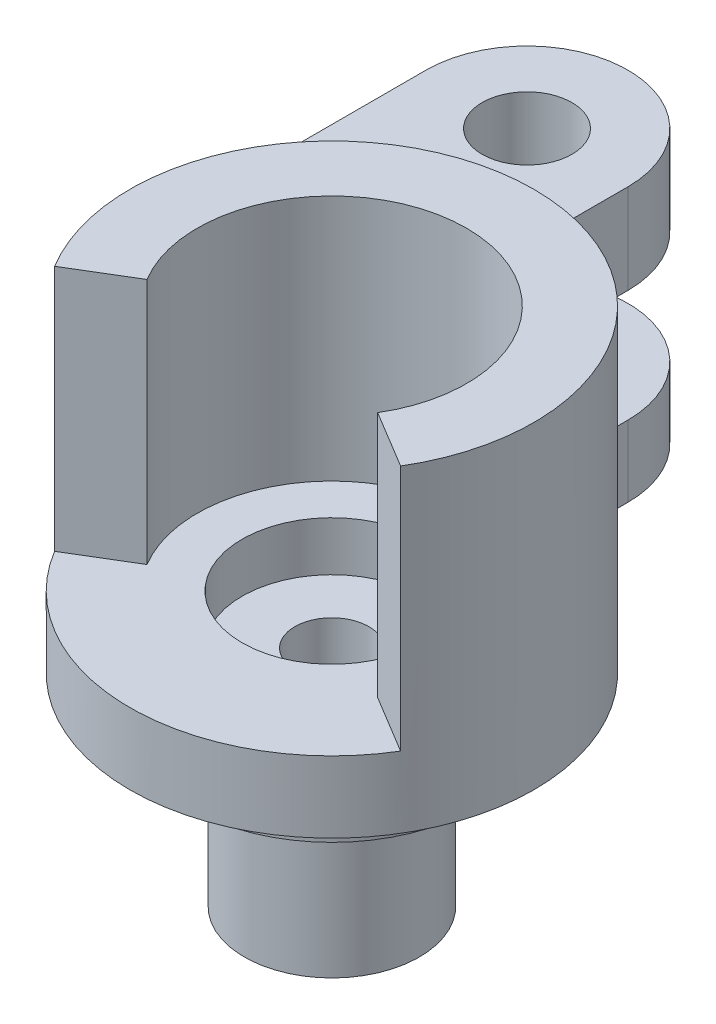
ISO-10303-21;
HEADER;
FILE_DESCRIPTION(('STEP AP214'),'2;1');
FILE_NAME('part.step','',(''),(''),'','','');
FILE_SCHEMA(('AUTOMOTIVE_DESIGN { 1 0 10303 214 1 1 1 1 }'));
ENDSEC;
DATA;
#1=APPLICATION_CONTEXT('core data for automotive mechanical design processes');
#2=APPLICATION_PROTOCOL_DEFINITION('international standard','automotive_design',2000,#1);
#3=PRODUCT_CONTEXT('',#1,'mechanical');
#4=PRODUCT('Part','Part','',(#3));
#5=PRODUCT_RELATED_PRODUCT_CATEGORY('part','',(#4));
#6=PRODUCT_DEFINITION_FORMATION('','',#4);
#7=PRODUCT_DEFINITION_CONTEXT('part definition',#1,'design');
#8=PRODUCT_DEFINITION('design','',#6,#7);
#9=PRODUCT_DEFINITION_SHAPE('','',#8);
#10=(LENGTH_UNIT() NAMED_UNIT(*) SI_UNIT(.MILLI.,.METRE.));
#11=(NAMED_UNIT(*) PLANE_ANGLE_UNIT() SI_UNIT($,.RADIAN.));
#12=(NAMED_UNIT(*) SI_UNIT($,.STERADIAN.) SOLID_ANGLE_UNIT());
#13=UNCERTAINTY_MEASURE_WITH_UNIT(LENGTH_MEASURE(1.E-05),#10,'distance_accuracy_value','');
#14=(GEOMETRIC_REPRESENTATION_CONTEXT(3) GLOBAL_UNCERTAINTY_ASSIGNED_CONTEXT((#13)) GLOBAL_UNIT_ASSIGNED_CONTEXT((#10,
#11,#12)) REPRESENTATION_CONTEXT('',''));
#15=CARTESIAN_POINT('',(0.,0.,0.));
#16=DIRECTION('',(0.,0.,1.));
#17=DIRECTION('',(1.,0.,0.));
#18=AXIS2_PLACEMENT_3D('',#15,#16,#17);
#19=CARTESIAN_POINT('',(0.,-13.6669047975957,0.));
#20=DIRECTION('',(0.,1.,0.));
#21=DIRECTION('',(0.,0.,1.));
#22=AXIS2_PLACEMENT_3D('',#19,#20,#21);
#23=CYLINDRICAL_SURFACE('',#22,1.650000048);
#24=CARTESIAN_POINT('',(0.,-8.999999906,0.));
#25=DIRECTION('',(0.,-1.,0.));
#26=DIRECTION('',(0.,0.,-1.));
#27=AXIS2_PLACEMENT_3D('',#24,#25,#26);
#28=CIRCLE('',#27,1.650000048);
#29=CARTESIAN_POINT('',(0.,-8.999999906,-1.650000048));
#30=VERTEX_POINT('',#29);
#31=EDGE_CURVE('E626',#30,#30,#28,.F.);
#32=ORIENTED_EDGE('',*,*,#31,.F.);
#33=EDGE_LOOP('',(#32));
#34=FACE_BOUND('',#33,.T.);
#35=CARTESIAN_POINT('',(0.,0.975,0.));
#36=DIRECTION('',(0.,1.,0.));
#37=DIRECTION('',(0.,0.,1.));
#38=AXIS2_PLACEMENT_3D('',#35,#36,#37);
#39=CIRCLE('',#38,1.650000048);
#40=CARTESIAN_POINT('',(0.,0.975,1.650000048));
#41=VERTEX_POINT('',#40);
#42=EDGE_CURVE('E47',#41,#41,#39,.F.);
#43=ORIENTED_EDGE('',*,*,#42,.F.);
#44=EDGE_LOOP('',(#43));
#45=FACE_BOUND('',#44,.T.);
#46=ADVANCED_FACE('F43',(#34,#45),#23,.F.);
#47=CARTESIAN_POINT('',(0.,3.175,0.));
#48=DIRECTION('',(0.,-1.,0.));
#49=DIRECTION('',(0.,0.,-1.));
#50=AXIS2_PLACEMENT_3D('',#47,#48,#49);
#51=CYLINDRICAL_SURFACE('',#50,9.);
#52=DIRECTION('',(0.,-1.,0.));
#53=VECTOR('',#52,1.);
#54=CARTESIAN_POINT('',(0.,12.174999906,-9.));
#55=LINE('',#54,#53);
#56=CARTESIAN_POINT('',(0.,12.174999906,-9.));
#57=VERTEX_POINT('',#56);
#58=CARTESIAN_POINT('',(0.,8.174999906,-9.));
#59=VERTEX_POINT('',#58);
#60=EDGE_CURVE('E61',#57,#59,#55,.T.);
#61=ORIENTED_EDGE('',*,*,#60,.F.);
#62=CARTESIAN_POINT('',(0.,12.174999906,0.));
#63=DIRECTION('',(0.,-1.,0.));
#64=DIRECTION('',(0.,0.,1.));
#65=AXIS2_PLACEMENT_3D('',#62,#63,#64);
#66=CIRCLE('',#65,9.);
#67=CARTESIAN_POINT('',(-9.,12.174999906,0.));
#68=VERTEX_POINT('',#67);
#69=EDGE_CURVE('E66',#68,#57,#66,.T.);
#70=ORIENTED_EDGE('',*,*,#69,.F.);
#71=DIRECTION('',(0.,-1.,0.));
#72=VECTOR('',#71,1.);
#73=CARTESIAN_POINT('',(-9.,12.174999906,0.));
#74=LINE('',#73,#72);
#75=CARTESIAN_POINT('',(-9.,8.174999906,0.));
#76=VERTEX_POINT('',#75);
#77=EDGE_CURVE('E158',#68,#76,#74,.T.);
#78=ORIENTED_EDGE('',*,*,#77,.T.);
#79=CARTESIAN_POINT('',(0.,8.174999906,0.));
#80=DIRECTION('',(0.,-1.,0.));
#81=DIRECTION('',(0.,0.,1.));
#82=AXIS2_PLACEMENT_3D('',#79,#80,#81);
#83=CIRCLE('',#82,9.);
#84=EDGE_CURVE('E162',#76,#59,#83,.T.);
#85=ORIENTED_EDGE('',*,*,#84,.T.);
#86=EDGE_LOOP('',(#61,#70,#78,#85));
#87=FACE_BOUND('',#86,.T.);
#88=CARTESIAN_POINT('',(0.,3.175,0.));
#89=DIRECTION('',(0.,1.,0.));
#90=DIRECTION('',(0.,0.,1.));
#91=AXIS2_PLACEMENT_3D('',#88,#89,#90);
#92=CIRCLE('',#91,9.);
#93=CARTESIAN_POINT('',(-7.70770438364841,3.175,4.64664321142554));
#94=VERTEX_POINT('',#93);
#95=CARTESIAN_POINT('',(7.70770438364841,3.175,4.64664321142554));
#96=VERTEX_POINT('',#95);
#97=EDGE_CURVE('E235',#94,#96,#92,.T.);
#98=ORIENTED_EDGE('',*,*,#97,.F.);
#99=DIRECTION('',(0.,-1.,0.));
#100=VECTOR('',#99,1.);
#101=CARTESIAN_POINT('',(-7.70770438364841,14.175,4.64664321142554));
#102=LINE('',#101,#100);
#103=CARTESIAN_POINT('',(-7.70770438364841,14.175,4.64664321142554));
#104=VERTEX_POINT('',#103);
#105=EDGE_CURVE('E272',#104,#94,#102,.T.);
#106=ORIENTED_EDGE('',*,*,#105,.F.);
#107=CARTESIAN_POINT('',(0.,14.175,0.));
#108=DIRECTION('',(0.,1.,0.));
#109=DIRECTION('',(0.,0.,-1.));
#110=AXIS2_PLACEMENT_3D('',#107,#108,#109);
#111=CIRCLE('',#110,9.);
#112=CARTESIAN_POINT('',(7.70770438364841,14.175,4.64664321142554));
#113=VERTEX_POINT('',#112);
#114=EDGE_CURVE('E236',#113,#104,#111,.T.);
#115=ORIENTED_EDGE('',*,*,#114,.F.);
#116=DIRECTION('',(0.,-1.,0.));
#117=VECTOR('',#116,1.);
#118=CARTESIAN_POINT('',(7.70770438364841,14.175,4.64664321142554));
#119=LINE('',#118,#117);
#120=EDGE_CURVE('E250',#113,#96,#119,.T.);
#121=ORIENTED_EDGE('',*,*,#120,.T.);
#122=EDGE_LOOP('',(#98,#106,#115,#121));
#123=FACE_BOUND('',#122,.T.);
#124=DIRECTION('',(0.,-1.,0.));
#125=VECTOR('',#124,1.);
#126=CARTESIAN_POINT('',(0.,23.0265647372949,-9.));
#127=LINE('',#126,#125);
#128=CARTESIAN_POINT('',(0.,3.175,-9.));
#129=VERTEX_POINT('',#128);
#130=CARTESIAN_POINT('',(0.,0.,-9.));
#131=VERTEX_POINT('',#130);
#132=EDGE_CURVE('E197',#129,#131,#127,.T.);
#133=ORIENTED_EDGE('',*,*,#132,.F.);
#134=CARTESIAN_POINT('',(0.,3.175,0.));
#135=DIRECTION('',(0.,1.,0.));
#136=DIRECTION('',(0.,0.,1.));
#137=AXIS2_PLACEMENT_3D('',#134,#135,#136);
#138=CIRCLE('',#137,9.);
#139=CARTESIAN_POINT('',(-9.,3.175,0.));
#140=VERTEX_POINT('',#139);
#141=EDGE_CURVE('E207',#140,#129,#138,.F.);
#142=ORIENTED_EDGE('',*,*,#141,.F.);
#143=DIRECTION('',(0.,-1.,0.));
#144=VECTOR('',#143,1.);
#145=CARTESIAN_POINT('',(-9.,23.0265647372949,0.));
#146=LINE('',#145,#144);
#147=CARTESIAN_POINT('',(-9.,0.,0.));
#148=VERTEX_POINT('',#147);
#149=EDGE_CURVE('E181',#140,#148,#146,.T.);
#150=ORIENTED_EDGE('',*,*,#149,.T.);
#151=CARTESIAN_POINT('',(0.,0.,0.));
#152=DIRECTION('',(0.,1.,0.));
#153=DIRECTION('',(0.,0.,1.));
#154=AXIS2_PLACEMENT_3D('',#151,#152,#153);
#155=CIRCLE('',#154,9.);
#156=EDGE_CURVE('E276',#148,#131,#155,.T.);
#157=ORIENTED_EDGE('',*,*,#156,.T.);
#158=EDGE_LOOP('',(#133,#142,#150,#157));
#159=FACE_BOUND('',#158,.T.);
#160=ADVANCED_FACE('F45',(#87,#123,#159),#51,.T.);
#161=CARTESIAN_POINT('',(0.,3.175,0.));
#162=DIRECTION('',(0.,1.,0.));
#163=DIRECTION('',(0.,0.,1.));
#164=AXIS2_PLACEMENT_3D('',#161,#162,#163);
#165=PLANE('',#164);
#166=CARTESIAN_POINT('',(0.,3.175,0.));
#167=DIRECTION('',(0.,1.,0.));
#168=DIRECTION('',(0.,0.,1.));
#169=AXIS2_PLACEMENT_3D('',#166,#167,#168);
#170=CIRCLE('',#169,4.);
#171=CARTESIAN_POINT('',(0.,3.175,4.));
#172=VERTEX_POINT('',#171);
#173=EDGE_CURVE('E602',#172,#172,#170,.T.);
#174=ORIENTED_EDGE('',*,*,#173,.F.);
#175=EDGE_LOOP('',(#174));
#176=FACE_BOUND('',#175,.T.);
#177=DIRECTION('',(0.856411598183157,0.,0.516293690158394));
#178=VECTOR('',#177,1.);
#179=CARTESIAN_POINT('',(5.13846958909894,3.175,3.09776214095036));
#180=LINE('',#179,#178);
#181=CARTESIAN_POINT('',(5.13846958909894,3.175,3.09776214095036));
#182=VERTEX_POINT('',#181);
#183=EDGE_CURVE('E241',#182,#96,#180,.T.);
#184=ORIENTED_EDGE('',*,*,#183,.F.);
#185=CARTESIAN_POINT('',(0.,3.175,0.));
#186=DIRECTION('',(0.,-1.,0.));
#187=DIRECTION('',(0.,0.,-1.));
#188=AXIS2_PLACEMENT_3D('',#185,#186,#187);
#189=CIRCLE('',#188,6.);
#190=CARTESIAN_POINT('',(-5.13846958909894,3.175,3.09776214095036));
#191=VERTEX_POINT('',#190);
#192=EDGE_CURVE('E254',#191,#182,#189,.T.);
#193=ORIENTED_EDGE('',*,*,#192,.F.);
#194=DIRECTION('',(0.856411598183157,0.,-0.516293690158393));
#195=VECTOR('',#194,1.);
#196=CARTESIAN_POINT('',(-7.70770438364841,3.175,4.64664321142554));
#197=LINE('',#196,#195);
#198=EDGE_CURVE('E231',#94,#191,#197,.T.);
#199=ORIENTED_EDGE('',*,*,#198,.F.);
#200=ORIENTED_EDGE('',*,*,#97,.T.);
#201=EDGE_LOOP('',(#184,#193,#199,#200));
#202=FACE_BOUND('',#201,.T.);
#203=ADVANCED_FACE('F315',(#176,#202),#165,.T.);
#204=CARTESIAN_POINT('',(0.,0.,0.));
#205=DIRECTION('',(0.,1.,0.));
#206=DIRECTION('',(0.,0.,1.));
#207=AXIS2_PLACEMENT_3D('',#204,#205,#206);
#208=PLANE('',#207);
#209=CARTESIAN_POINT('',(0.,0.,0.));
#210=DIRECTION('',(0.,-1.,0.));
#211=DIRECTION('',(0.,0.,-1.));
#212=AXIS2_PLACEMENT_3D('',#209,#210,#211);
#213=CIRCLE('',#212,6.399999954);
#214=CARTESIAN_POINT('',(0.,0.,-6.399999954));
#215=VERTEX_POINT('',#214);
#216=EDGE_CURVE('E53',#215,#215,#213,.T.);
#217=ORIENTED_EDGE('',*,*,#216,.F.);
#218=EDGE_LOOP('',(#217));
#219=FACE_BOUND('',#218,.T.);
#220=ORIENTED_EDGE('',*,*,#156,.F.);
#221=DIRECTION('',(0.,0.,1.));
#222=VECTOR('',#221,1.);
#223=CARTESIAN_POINT('',(-9.,0.,0.));
#224=LINE('',#223,#222);
#225=CARTESIAN_POINT('',(-9.,0.,-13.1941974251168));
#226=VERTEX_POINT('',#225);
#227=EDGE_CURVE('E182',#226,#148,#224,.T.);
#228=ORIENTED_EDGE('',*,*,#227,.F.);
#229=CARTESIAN_POINT('',(-4.5,0.,-13.1941974251168));
#230=DIRECTION('',(0.,1.,0.));
#231=DIRECTION('',(0.,0.,1.));
#232=AXIS2_PLACEMENT_3D('',#229,#230,#231);
#233=CIRCLE('',#232,4.5);
#234=CARTESIAN_POINT('',(0.,0.,-13.1941974251168));
#235=VERTEX_POINT('',#234);
#236=EDGE_CURVE('E188',#235,#226,#233,.T.);
#237=ORIENTED_EDGE('',*,*,#236,.F.);
#238=DIRECTION('',(0.,0.,-1.));
#239=VECTOR('',#238,1.);
#240=CARTESIAN_POINT('',(0.,0.,-9.));
#241=LINE('',#240,#239);
#242=EDGE_CURVE('E193',#131,#235,#241,.T.);
#243=ORIENTED_EDGE('',*,*,#242,.F.);
#244=EDGE_LOOP('',(#220,#228,#237,#243));
#245=FACE_BOUND('',#244,.T.);
#246=ADVANCED_FACE('F289',(#219,#245),#208,.F.);
#247=CARTESIAN_POINT('',(-7.70770438364841,14.175,4.64664321142554));
#248=DIRECTION('',(-0.516293690158393,0.,-0.856411598183157));
#249=DIRECTION('',(-0.856411598183157,0.,0.516293690158393));
#250=AXIS2_PLACEMENT_3D('',#247,#248,#249);
#251=PLANE('',#250);
#252=ORIENTED_EDGE('',*,*,#198,.T.);
#253=DIRECTION('',(0.,-1.,0.));
#254=VECTOR('',#253,1.);
#255=CARTESIAN_POINT('',(-5.13846958909894,14.175,3.09776214095036));
#256=LINE('',#255,#254);
#257=CARTESIAN_POINT('',(-5.13846958909894,14.175,3.09776214095036));
#258=VERTEX_POINT('',#257);
#259=EDGE_CURVE('E268',#258,#191,#256,.T.);
#260=ORIENTED_EDGE('',*,*,#259,.F.);
#261=DIRECTION('',(0.856411598183157,0.,-0.516293690158393));
#262=VECTOR('',#261,1.);
#263=CARTESIAN_POINT('',(-7.70770438364841,14.175,4.64664321142554));
#264=LINE('',#263,#262);
#265=EDGE_CURVE('E240',#104,#258,#264,.T.);
#266=ORIENTED_EDGE('',*,*,#265,.F.);
#267=ORIENTED_EDGE('',*,*,#105,.T.);
#268=EDGE_LOOP('',(#252,#260,#266,#267));
#269=FACE_BOUND('',#268,.T.);
#270=ADVANCED_FACE('F477',(#269),#251,.F.);
#271=CARTESIAN_POINT('',(0.,14.175,0.));
#272=DIRECTION('',(0.,-1.,0.));
#273=DIRECTION('',(0.,0.,-1.));
#274=AXIS2_PLACEMENT_3D('',#271,#272,#273);
#275=CYLINDRICAL_SURFACE('',#274,6.);
#276=ORIENTED_EDGE('',*,*,#192,.T.);
#277=DIRECTION('',(0.,-1.,0.));
#278=VECTOR('',#277,1.);
#279=CARTESIAN_POINT('',(5.13846958909894,14.175,3.09776214095036));
#280=LINE('',#279,#278);
#281=CARTESIAN_POINT('',(5.13846958909894,14.175,3.09776214095036));
#282=VERTEX_POINT('',#281);
#283=EDGE_CURVE('E264',#282,#182,#280,.T.);
#284=ORIENTED_EDGE('',*,*,#283,.F.);
#285=CARTESIAN_POINT('',(0.,14.175,0.));
#286=DIRECTION('',(0.,-1.,0.));
#287=DIRECTION('',(0.,0.,-1.));
#288=AXIS2_PLACEMENT_3D('',#285,#286,#287);
#289=CIRCLE('',#288,6.);
#290=EDGE_CURVE('E244',#258,#282,#289,.T.);
#291=ORIENTED_EDGE('',*,*,#290,.F.);
#292=ORIENTED_EDGE('',*,*,#259,.T.);
#293=EDGE_LOOP('',(#276,#284,#291,#292));
#294=FACE_BOUND('',#293,.T.);
#295=ADVANCED_FACE('F546',(#294),#275,.F.);
#296=CARTESIAN_POINT('',(5.13846958909894,14.175,3.09776214095036));
#297=DIRECTION('',(0.516293690158394,0.,-0.856411598183157));
#298=DIRECTION('',(-0.856411598183157,0.,-0.516293690158394));
#299=AXIS2_PLACEMENT_3D('',#296,#297,#298);
#300=PLANE('',#299);
#301=ORIENTED_EDGE('',*,*,#183,.T.);
#302=ORIENTED_EDGE('',*,*,#120,.F.);
#303=DIRECTION('',(0.856411598183157,0.,0.516293690158394));
#304=VECTOR('',#303,1.);
#305=CARTESIAN_POINT('',(5.13846958909894,14.175,3.09776214095036));
#306=LINE('',#305,#304);
#307=EDGE_CURVE('E247',#282,#113,#306,.T.);
#308=ORIENTED_EDGE('',*,*,#307,.F.);
#309=ORIENTED_EDGE('',*,*,#283,.T.);
#310=EDGE_LOOP('',(#301,#302,#308,#309));
#311=FACE_BOUND('',#310,.T.);
#312=ADVANCED_FACE('F536',(#311),#300,.F.);
#313=CARTESIAN_POINT('',(0.,14.175,0.));
#314=DIRECTION('',(0.,-1.,0.));
#315=DIRECTION('',(0.,0.,-1.));
#316=AXIS2_PLACEMENT_3D('',#313,#314,#315);
#317=PLANE('',#316);
#318=ORIENTED_EDGE('',*,*,#114,.T.);
#319=ORIENTED_EDGE('',*,*,#265,.T.);
#320=ORIENTED_EDGE('',*,*,#290,.T.);
#321=ORIENTED_EDGE('',*,*,#307,.T.);
#322=EDGE_LOOP('',(#318,#319,#320,#321));
#323=FACE_BOUND('',#322,.T.);
#324=ADVANCED_FACE('F526',(#323),#317,.F.);
#325=CARTESIAN_POINT('',(0.,-2.,0.));
#326=DIRECTION('',(0.,1.,0.));
#327=DIRECTION('',(0.,0.,1.));
#328=AXIS2_PLACEMENT_3D('',#325,#326,#327);
#329=CYLINDRICAL_SURFACE('',#328,6.399999954);
#330=CARTESIAN_POINT('',(0.,-2.,0.));
#331=DIRECTION('',(0.,-1.,0.));
#332=DIRECTION('',(0.,0.,-1.));
#333=AXIS2_PLACEMENT_3D('',#330,#331,#332);
#334=CIRCLE('',#333,6.399999954);
#335=CARTESIAN_POINT('',(0.,-2.,-6.399999954));
#336=VERTEX_POINT('',#335);
#337=EDGE_CURVE('E226',#336,#336,#334,.T.);
#338=ORIENTED_EDGE('',*,*,#337,.F.);
#339=EDGE_LOOP('',(#338));
#340=FACE_BOUND('',#339,.T.);
#341=ORIENTED_EDGE('',*,*,#216,.T.);
#342=EDGE_LOOP('',(#341));
#343=FACE_BOUND('',#342,.T.);
#344=ADVANCED_FACE('F516',(#340,#343),#329,.T.);
#345=CARTESIAN_POINT('',(0.,-2.,0.));
#346=DIRECTION('',(0.,-1.,0.));
#347=DIRECTION('',(0.,0.,-1.));
#348=AXIS2_PLACEMENT_3D('',#345,#346,#347);
#349=PLANE('',#348);
#350=CARTESIAN_POINT('',(0.,-2.,0.));
#351=DIRECTION('',(0.,-1.,0.));
#352=DIRECTION('',(0.,0.,-1.));
#353=AXIS2_PLACEMENT_3D('',#350,#351,#352);
#354=CIRCLE('',#353,3.9000049);
#355=CARTESIAN_POINT('',(0.,-2.,-3.9000049));
#356=VERTEX_POINT('',#355);
#357=EDGE_CURVE('E11',#356,#356,#354,.T.);
#358=ORIENTED_EDGE('',*,*,#357,.F.);
#359=EDGE_LOOP('',(#358));
#360=FACE_BOUND('',#359,.T.);
#361=ORIENTED_EDGE('',*,*,#337,.T.);
#362=EDGE_LOOP('',(#361));
#363=FACE_BOUND('',#362,.T.);
#364=ADVANCED_FACE('F507',(#360,#363),#349,.T.);
#365=CARTESIAN_POINT('',(0.,-8.999999906,0.));
#366=DIRECTION('',(0.,1.,0.));
#367=DIRECTION('',(0.,0.,1.));
#368=AXIS2_PLACEMENT_3D('',#365,#366,#367);
#369=CYLINDRICAL_SURFACE('',#368,3.9000049);
#370=CARTESIAN_POINT('',(0.,-8.999999906,0.));
#371=DIRECTION('',(0.,-1.,0.));
#372=DIRECTION('',(0.,0.,-1.));
#373=AXIS2_PLACEMENT_3D('',#370,#371,#372);
#374=CIRCLE('',#373,3.9000049);
#375=CARTESIAN_POINT('',(0.,-8.999999906,-3.9000049));
#376=VERTEX_POINT('',#375);
#377=EDGE_CURVE('E202',#376,#376,#374,.T.);
#378=ORIENTED_EDGE('',*,*,#377,.F.);
#379=EDGE_LOOP('',(#378));
#380=FACE_BOUND('',#379,.T.);
#381=ORIENTED_EDGE('',*,*,#357,.T.);
#382=EDGE_LOOP('',(#381));
#383=FACE_BOUND('',#382,.T.);
#384=ADVANCED_FACE('F498',(#380,#383),#369,.T.);
#385=CARTESIAN_POINT('',(0.,-8.999999906,0.));
#386=DIRECTION('',(0.,-1.,0.));
#387=DIRECTION('',(0.,0.,-1.));
#388=AXIS2_PLACEMENT_3D('',#385,#386,#387);
#389=PLANE('',#388);
#390=ORIENTED_EDGE('',*,*,#31,.T.);
#391=EDGE_LOOP('',(#390));
#392=FACE_BOUND('',#391,.T.);
#393=ORIENTED_EDGE('',*,*,#377,.T.);
#394=EDGE_LOOP('',(#393));
#395=FACE_BOUND('',#394,.T.);
#396=ADVANCED_FACE('F467',(#392,#395),#389,.T.);
#397=CARTESIAN_POINT('',(0.,23.0265647372949,-9.));
#398=DIRECTION('',(-1.,0.,0.));
#399=DIRECTION('',(0.,0.,1.));
#400=AXIS2_PLACEMENT_3D('',#397,#398,#399);
#401=PLANE('',#400);
#402=DIRECTION('',(0.,0.,-1.));
#403=VECTOR('',#402,1.);
#404=CARTESIAN_POINT('',(0.,3.175,-9.));
#405=LINE('',#404,#403);
#406=CARTESIAN_POINT('',(0.,3.175,-13.1941974251168));
#407=VERTEX_POINT('',#406);
#408=EDGE_CURVE('E203',#129,#407,#405,.T.);
#409=ORIENTED_EDGE('',*,*,#408,.F.);
#410=ORIENTED_EDGE('',*,*,#132,.T.);
#411=ORIENTED_EDGE('',*,*,#242,.T.);
#412=DIRECTION('',(0.,-1.,0.));
#413=VECTOR('',#412,1.);
#414=CARTESIAN_POINT('',(0.,23.0265647372949,-13.1941974251168));
#415=LINE('',#414,#413);
#416=EDGE_CURVE('E192',#407,#235,#415,.T.);
#417=ORIENTED_EDGE('',*,*,#416,.F.);
#418=EDGE_LOOP('',(#409,#410,#411,#417));
#419=FACE_BOUND('',#418,.T.);
#420=ADVANCED_FACE('F286',(#419),#401,.F.);
#421=CARTESIAN_POINT('',(-4.5,23.0265647372949,-13.1941974251168));
#422=DIRECTION('',(0.,-1.,0.));
#423=DIRECTION('',(0.,0.,-1.));
#424=AXIS2_PLACEMENT_3D('',#421,#422,#423);
#425=CYLINDRICAL_SURFACE('',#424,4.5);
#426=CARTESIAN_POINT('',(-4.5,3.175,-13.1941974251168));
#427=DIRECTION('',(0.,1.,0.));
#428=DIRECTION('',(0.,0.,1.));
#429=AXIS2_PLACEMENT_3D('',#426,#427,#428);
#430=CIRCLE('',#429,4.5);
#431=CARTESIAN_POINT('',(-9.,3.175,-13.1941974251168));
#432=VERTEX_POINT('',#431);
#433=EDGE_CURVE('E198',#407,#432,#430,.T.);
#434=ORIENTED_EDGE('',*,*,#433,.F.);
#435=ORIENTED_EDGE('',*,*,#416,.T.);
#436=ORIENTED_EDGE('',*,*,#236,.T.);
#437=DIRECTION('',(0.,-1.,0.));
#438=VECTOR('',#437,1.);
#439=CARTESIAN_POINT('',(-9.,23.0265647372949,-13.1941974251168));
#440=LINE('',#439,#438);
#441=EDGE_CURVE('E187',#432,#226,#440,.T.);
#442=ORIENTED_EDGE('',*,*,#441,.F.);
#443=EDGE_LOOP('',(#434,#435,#436,#442));
#444=FACE_BOUND('',#443,.T.);
#445=ADVANCED_FACE('F291',(#444),#425,.T.);
#446=CARTESIAN_POINT('',(-9.,23.0265647372949,0.));
#447=DIRECTION('',(1.,0.,0.));
#448=DIRECTION('',(0.,0.,-1.));
#449=AXIS2_PLACEMENT_3D('',#446,#447,#448);
#450=PLANE('',#449);
#451=DIRECTION('',(0.,0.,1.));
#452=VECTOR('',#451,1.);
#453=CARTESIAN_POINT('',(-9.,3.175,0.));
#454=LINE('',#453,#452);
#455=EDGE_CURVE('E186',#432,#140,#454,.T.);
#456=ORIENTED_EDGE('',*,*,#455,.F.);
#457=ORIENTED_EDGE('',*,*,#441,.T.);
#458=ORIENTED_EDGE('',*,*,#227,.T.);
#459=ORIENTED_EDGE('',*,*,#149,.F.);
#460=EDGE_LOOP('',(#456,#457,#458,#459));
#461=FACE_BOUND('',#460,.T.);
#462=ADVANCED_FACE('F296',(#461),#450,.F.);
#463=CARTESIAN_POINT('',(0.,3.175,0.));
#464=DIRECTION('',(0.,1.,0.));
#465=DIRECTION('',(0.,0.,1.));
#466=AXIS2_PLACEMENT_3D('',#463,#464,#465);
#467=PLANE('',#466);
#468=CARTESIAN_POINT('',(-4.5,3.175,-13.1941974251168));
#469=DIRECTION('',(0.,1.,0.));
#470=DIRECTION('',(0.,0.,1.));
#471=AXIS2_PLACEMENT_3D('',#468,#469,#470);
#472=CIRCLE('',#471,1.7145);
#473=CARTESIAN_POINT('',(-4.5,3.175,-11.4796974251168));
#474=VERTEX_POINT('',#473);
#475=EDGE_CURVE('E622',#474,#474,#472,.T.);
#476=ORIENTED_EDGE('',*,*,#475,.F.);
#477=EDGE_LOOP('',(#476));
#478=FACE_BOUND('',#477,.T.);
#479=ORIENTED_EDGE('',*,*,#455,.T.);
#480=ORIENTED_EDGE('',*,*,#141,.T.);
#481=ORIENTED_EDGE('',*,*,#408,.T.);
#482=ORIENTED_EDGE('',*,*,#433,.T.);
#483=EDGE_LOOP('',(#479,#480,#481,#482));
#484=FACE_BOUND('',#483,.T.);
#485=ADVANCED_FACE('F294',(#478,#484),#467,.T.);
#486=CARTESIAN_POINT('',(0.,12.174999906,-9.));
#487=DIRECTION('',(-1.,0.,0.));
#488=DIRECTION('',(0.,0.,1.));
#489=AXIS2_PLACEMENT_3D('',#486,#487,#488);
#490=PLANE('',#489);
#491=DIRECTION('',(0.,0.,-1.));
#492=VECTOR('',#491,1.);
#493=CARTESIAN_POINT('',(0.,8.174999906,-9.));
#494=LINE('',#493,#492);
#495=CARTESIAN_POINT('',(0.,8.174999906,-13.1941974251168));
#496=VERTEX_POINT('',#495);
#497=EDGE_CURVE('E145',#59,#496,#494,.T.);
#498=ORIENTED_EDGE('',*,*,#497,.T.);
#499=DIRECTION('',(0.,-1.,0.));
#500=VECTOR('',#499,1.);
#501=CARTESIAN_POINT('',(0.,12.174999906,-13.1941974251168));
#502=LINE('',#501,#500);
#503=CARTESIAN_POINT('',(0.,12.174999906,-13.1941974251168));
#504=VERTEX_POINT('',#503);
#505=EDGE_CURVE('E142',#504,#496,#502,.T.);
#506=ORIENTED_EDGE('',*,*,#505,.F.);
#507=DIRECTION('',(0.,0.,-1.));
#508=VECTOR('',#507,1.);
#509=CARTESIAN_POINT('',(0.,12.174999906,-9.));
#510=LINE('',#509,#508);
#511=EDGE_CURVE('E132',#57,#504,#510,.T.);
#512=ORIENTED_EDGE('',*,*,#511,.F.);
#513=ORIENTED_EDGE('',*,*,#60,.T.);
#514=EDGE_LOOP('',(#498,#506,#512,#513));
#515=FACE_BOUND('',#514,.T.);
#516=ADVANCED_FACE('F143',(#515),#490,.F.);
#517=CARTESIAN_POINT('',(-4.5,12.174999906,-13.1941974251168));
#518=DIRECTION('',(0.,-1.,0.));
#519=DIRECTION('',(0.,0.,-1.));
#520=AXIS2_PLACEMENT_3D('',#517,#518,#519);
#521=CYLINDRICAL_SURFACE('',#520,4.5);
#522=CARTESIAN_POINT('',(-4.5,8.174999906,-13.1941974251168));
#523=DIRECTION('',(0.,1.,0.));
#524=DIRECTION('',(0.,0.,1.));
#525=AXIS2_PLACEMENT_3D('',#522,#523,#524);
#526=CIRCLE('',#525,4.5);
#527=CARTESIAN_POINT('',(-9.,8.174999906,-13.1941974251168));
#528=VERTEX_POINT('',#527);
#529=EDGE_CURVE('E168',#496,#528,#526,.T.);
#530=ORIENTED_EDGE('',*,*,#529,.T.);
#531=DIRECTION('',(0.,-1.,0.));
#532=VECTOR('',#531,1.);
#533=CARTESIAN_POINT('',(-9.,12.174999906,-13.1941974251168));
#534=LINE('',#533,#532);
#535=CARTESIAN_POINT('',(-9.,12.174999906,-13.1941974251168));
#536=VERTEX_POINT('',#535);
#537=EDGE_CURVE('E149',#536,#528,#534,.T.);
#538=ORIENTED_EDGE('',*,*,#537,.F.);
#539=CARTESIAN_POINT('',(-4.5,12.174999906,-13.1941974251168));
#540=DIRECTION('',(0.,1.,0.));
#541=DIRECTION('',(0.,0.,1.));
#542=AXIS2_PLACEMENT_3D('',#539,#540,#541);
#543=CIRCLE('',#542,4.5);
#544=EDGE_CURVE('E136',#504,#536,#543,.T.);
#545=ORIENTED_EDGE('',*,*,#544,.F.);
#546=ORIENTED_EDGE('',*,*,#505,.T.);
#547=EDGE_LOOP('',(#530,#538,#545,#546));
#548=FACE_BOUND('',#547,.T.);
#549=ADVANCED_FACE('F151',(#548),#521,.T.);
#550=CARTESIAN_POINT('',(-9.,12.174999906,-13.1941974251168));
#551=DIRECTION('',(1.,0.,0.));
#552=DIRECTION('',(0.,0.,-1.));
#553=AXIS2_PLACEMENT_3D('',#550,#551,#552);
#554=PLANE('',#553);
#555=DIRECTION('',(0.,0.,1.));
#556=VECTOR('',#555,1.);
#557=CARTESIAN_POINT('',(-9.,8.174999906,-13.1941974251168));
#558=LINE('',#557,#556);
#559=EDGE_CURVE('E171',#528,#76,#558,.T.);
#560=ORIENTED_EDGE('',*,*,#559,.T.);
#561=ORIENTED_EDGE('',*,*,#77,.F.);
#562=DIRECTION('',(0.,0.,1.));
#563=VECTOR('',#562,1.);
#564=CARTESIAN_POINT('',(-9.,12.174999906,-13.1941974251168));
#565=LINE('',#564,#563);
#566=EDGE_CURVE('E155',#536,#68,#565,.T.);
#567=ORIENTED_EDGE('',*,*,#566,.F.);
#568=ORIENTED_EDGE('',*,*,#537,.T.);
#569=EDGE_LOOP('',(#560,#561,#567,#568));
#570=FACE_BOUND('',#569,.T.);
#571=ADVANCED_FACE('F330',(#570),#554,.F.);
#572=CARTESIAN_POINT('',(0.,12.174999906,0.));
#573=DIRECTION('',(0.,1.,0.));
#574=DIRECTION('',(0.,0.,1.));
#575=AXIS2_PLACEMENT_3D('',#572,#573,#574);
#576=PLANE('',#575);
#577=CARTESIAN_POINT('',(-4.5,12.174999906,-13.1941974251168));
#578=DIRECTION('',(0.,1.,0.));
#579=DIRECTION('',(0.,0.,1.));
#580=AXIS2_PLACEMENT_3D('',#577,#578,#579);
#581=CIRCLE('',#580,2.);
#582=CARTESIAN_POINT('',(-4.5,12.174999906,-11.1941974251168));
#583=VERTEX_POINT('',#582);
#584=EDGE_CURVE('E630',#583,#583,#581,.T.);
#585=ORIENTED_EDGE('',*,*,#584,.F.);
#586=EDGE_LOOP('',(#585));
#587=FACE_BOUND('',#586,.T.);
#588=ORIENTED_EDGE('',*,*,#69,.T.);
#589=ORIENTED_EDGE('',*,*,#511,.T.);
#590=ORIENTED_EDGE('',*,*,#544,.T.);
#591=ORIENTED_EDGE('',*,*,#566,.T.);
#592=EDGE_LOOP('',(#588,#589,#590,#591));
#593=FACE_BOUND('',#592,.T.);
#594=ADVANCED_FACE('F134',(#587,#593),#576,.T.);
#595=CARTESIAN_POINT('',(0.,8.174999906,0.));
#596=DIRECTION('',(0.,1.,0.));
#597=DIRECTION('',(0.,0.,1.));
#598=AXIS2_PLACEMENT_3D('',#595,#596,#597);
#599=PLANE('',#598);
#600=CARTESIAN_POINT('',(-4.5,8.174999906,-13.1941974251168));
#601=DIRECTION('',(0.,1.,0.));
#602=DIRECTION('',(0.,0.,1.));
#603=AXIS2_PLACEMENT_3D('',#600,#601,#602);
#604=CIRCLE('',#603,2.);
#605=CARTESIAN_POINT('',(-4.5,8.174999906,-11.1941974251168));
#606=VERTEX_POINT('',#605);
#607=EDGE_CURVE('E165',#606,#606,#604,.F.);
#608=ORIENTED_EDGE('',*,*,#607,.F.);
#609=EDGE_LOOP('',(#608));
#610=FACE_BOUND('',#609,.T.);
#611=ORIENTED_EDGE('',*,*,#84,.F.);
#612=ORIENTED_EDGE('',*,*,#559,.F.);
#613=ORIENTED_EDGE('',*,*,#529,.F.);
#614=ORIENTED_EDGE('',*,*,#497,.F.);
#615=EDGE_LOOP('',(#611,#612,#613,#614));
#616=FACE_BOUND('',#615,.T.);
#617=ADVANCED_FACE('F326',(#610,#616),#599,.F.);
#618=CARTESIAN_POINT('',(-4.5,2.51814565650762,-13.1941974251168));
#619=DIRECTION('',(0.,1.,0.));
#620=DIRECTION('',(0.,0.,1.));
#621=AXIS2_PLACEMENT_3D('',#618,#619,#620);
#622=CYLINDRICAL_SURFACE('',#621,2.);
#623=ORIENTED_EDGE('',*,*,#607,.T.);
#624=EDGE_LOOP('',(#623));
#625=FACE_BOUND('',#624,.T.);
#626=ORIENTED_EDGE('',*,*,#584,.T.);
#627=EDGE_LOOP('',(#626));
#628=FACE_BOUND('',#627,.T.);
#629=ADVANCED_FACE('F322',(#625,#628),#622,.F.);
#630=CARTESIAN_POINT('',(0.,0.975,0.));
#631=DIRECTION('',(0.,1.,0.));
#632=DIRECTION('',(0.,0.,1.));
#633=AXIS2_PLACEMENT_3D('',#630,#631,#632);
#634=PLANE('',#633);
#635=CARTESIAN_POINT('',(0.,0.975,0.));
#636=DIRECTION('',(0.,1.,0.));
#637=DIRECTION('',(0.,0.,1.));
#638=AXIS2_PLACEMENT_3D('',#635,#636,#637);
#639=CIRCLE('',#638,4.);
#640=CARTESIAN_POINT('',(0.,0.975,4.));
#641=VERTEX_POINT('',#640);
#642=EDGE_CURVE('E614',#641,#641,#639,.T.);
#643=ORIENTED_EDGE('',*,*,#642,.T.);
#644=EDGE_LOOP('',(#643));
#645=FACE_BOUND('',#644,.T.);
#646=ORIENTED_EDGE('',*,*,#42,.T.);
#647=EDGE_LOOP('',(#646));
#648=FACE_BOUND('',#647,.T.);
#649=ADVANCED_FACE('F325',(#645,#648),#634,.T.);
#650=CARTESIAN_POINT('',(0.,0.975,0.));
#651=DIRECTION('',(0.,1.,0.));
#652=DIRECTION('',(0.,0.,1.));
#653=AXIS2_PLACEMENT_3D('',#650,#651,#652);
#654=CYLINDRICAL_SURFACE('',#653,4.);
#655=ORIENTED_EDGE('',*,*,#642,.F.);
#656=EDGE_LOOP('',(#655));
#657=FACE_BOUND('',#656,.T.);
#658=ORIENTED_EDGE('',*,*,#173,.T.);
#659=EDGE_LOOP('',(#658));
#660=FACE_BOUND('',#659,.T.);
#661=ADVANCED_FACE('F320',(#657,#660),#654,.F.);
#662=CARTESIAN_POINT('',(-4.5,1.675,-13.1941974251168));
#663=DIRECTION('',(0.,1.,0.));
#664=DIRECTION('',(0.,0.,1.));
#665=AXIS2_PLACEMENT_3D('',#662,#663,#664);
#666=CYLINDRICAL_SURFACE('',#665,1.7145);
#667=CARTESIAN_POINT('',(-4.5,1.675,-13.1941974251168));
#668=DIRECTION('',(0.,1.,0.));
#669=DIRECTION('',(0.,0.,1.));
#670=AXIS2_PLACEMENT_3D('',#667,#668,#669);
#671=CIRCLE('',#670,1.7145);
#672=CARTESIAN_POINT('',(-4.5,1.675,-11.4796974251168));
#673=VERTEX_POINT('',#672);
#674=EDGE_CURVE('E615',#673,#673,#671,.T.);
#675=ORIENTED_EDGE('',*,*,#674,.F.);
#676=EDGE_LOOP('',(#675));
#677=FACE_BOUND('',#676,.T.);
#678=ORIENTED_EDGE('',*,*,#475,.T.);
#679=EDGE_LOOP('',(#678));
#680=FACE_BOUND('',#679,.T.);
#681=ADVANCED_FACE('F378',(#677,#680),#666,.F.);
#682=CARTESIAN_POINT('',(-4.5,1.675,-13.1941974251168));
#683=DIRECTION('',(0.,1.,0.));
#684=DIRECTION('',(0.,0.,1.));
#685=AXIS2_PLACEMENT_3D('',#682,#683,#684);
#686=PLANE('',#685);
#687=ORIENTED_EDGE('',*,*,#674,.T.);
#688=EDGE_LOOP('',(#687));
#689=FACE_BOUND('',#688,.T.);
#690=ADVANCED_FACE('F385',(#689),#686,.T.);
#691=CLOSED_SHELL('',(#46,#160,#203,#246,#270,#295,#312,#324,#344,#364,#384,#396,#420,#445,#462,
#485,#516,#549,#571,#594,#617,#629,#649,#661,#681,#690));
#692=MANIFOLD_SOLID_BREP('B2',#691);
#693=ADVANCED_BREP_SHAPE_REPRESENTATION('',(#18,#692),#14);
#694=SHAPE_DEFINITION_REPRESENTATION(#9,#693);
ENDSEC;
END-ISO-10303-21;
